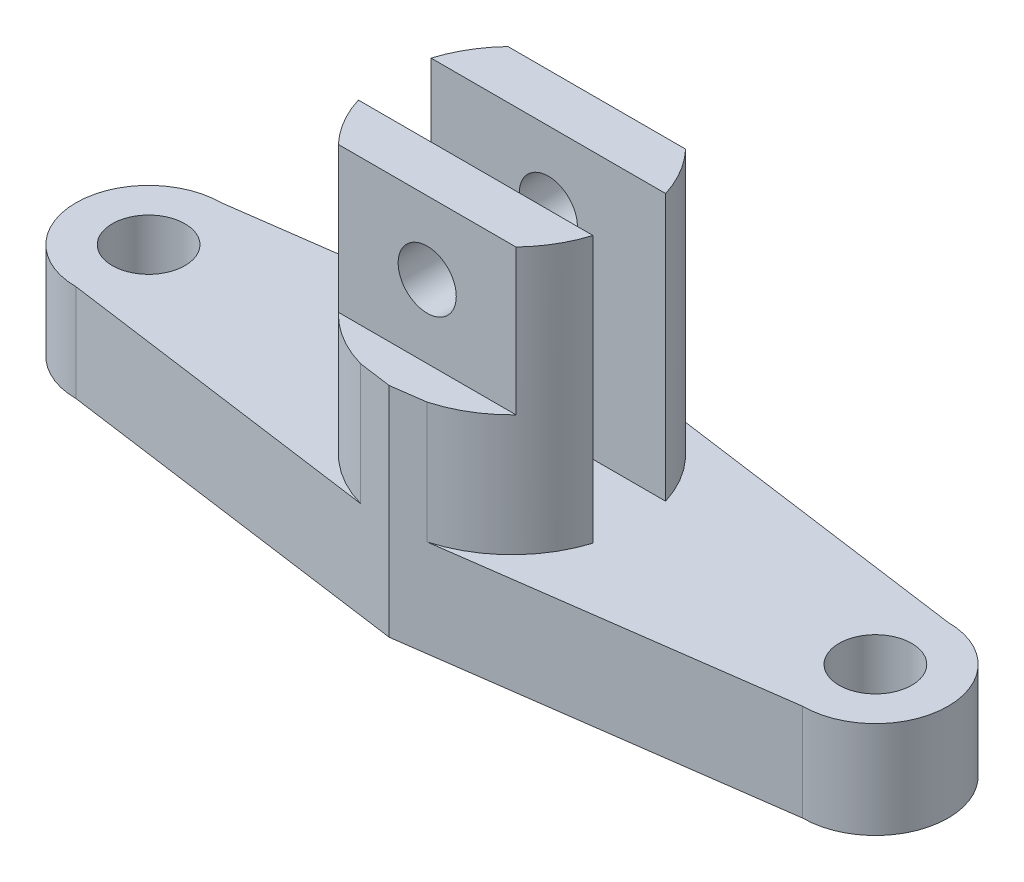
ISO-10303-21;
HEADER;
FILE_DESCRIPTION(('STEP AP214'),'2;1');
FILE_NAME('part.step','',(''),(''),'','','');
FILE_SCHEMA(('AUTOMOTIVE_DESIGN { 1 0 10303 214 1 1 1 1 }'));
ENDSEC;
DATA;
#1=APPLICATION_CONTEXT('core data for automotive mechanical design processes');
#2=APPLICATION_PROTOCOL_DEFINITION('international standard','automotive_design',2000,#1);
#3=PRODUCT_CONTEXT('',#1,'mechanical');
#4=PRODUCT('Part','Part','',(#3));
#5=PRODUCT_RELATED_PRODUCT_CATEGORY('part','',(#4));
#6=PRODUCT_DEFINITION_FORMATION('','',#4);
#7=PRODUCT_DEFINITION_CONTEXT('part definition',#1,'design');
#8=PRODUCT_DEFINITION('design','',#6,#7);
#9=PRODUCT_DEFINITION_SHAPE('','',#8);
#10=(LENGTH_UNIT() NAMED_UNIT(*) SI_UNIT(.MILLI.,.METRE.));
#11=(NAMED_UNIT(*) PLANE_ANGLE_UNIT() SI_UNIT($,.RADIAN.));
#12=(NAMED_UNIT(*) SI_UNIT($,.STERADIAN.) SOLID_ANGLE_UNIT());
#13=UNCERTAINTY_MEASURE_WITH_UNIT(LENGTH_MEASURE(1.E-05),#10,'distance_accuracy_value','');
#14=(GEOMETRIC_REPRESENTATION_CONTEXT(3) GLOBAL_UNCERTAINTY_ASSIGNED_CONTEXT((#13)) GLOBAL_UNIT_ASSIGNED_CONTEXT((#10,
#11,#12)) REPRESENTATION_CONTEXT('',''));
#15=CARTESIAN_POINT('',(0.,0.,0.));
#16=DIRECTION('',(0.,0.,1.));
#17=DIRECTION('',(1.,0.,0.));
#18=AXIS2_PLACEMENT_3D('',#15,#16,#17);
#19=CARTESIAN_POINT('',(0.,45.,0.));
#20=DIRECTION('',(0.,1.,0.));
#21=DIRECTION('',(0.,0.,1.));
#22=AXIS2_PLACEMENT_3D('',#19,#20,#21);
#23=PLANE('',#22);
#24=CARTESIAN_POINT('',(0.,45.,0.));
#25=DIRECTION('',(0.,1.,0.));
#26=DIRECTION('',(0.,0.,1.));
#27=AXIS2_PLACEMENT_3D('',#24,#25,#26);
#28=CIRCLE('',#27,25.3395650697359);
#29=CARTESIAN_POINT('',(-6.85635949504464,45.,-24.3943414011957));
#30=VERTEX_POINT('',#29);
#31=CARTESIAN_POINT('',(-18.3260349755035,45.,-17.5));
#32=VERTEX_POINT('',#31);
#33=EDGE_CURVE('E69',#30,#32,#28,.T.);
#34=ORIENTED_EDGE('',*,*,#33,.T.);
#35=DIRECTION('',(1.,0.,0.));
#36=VECTOR('',#35,1.);
#37=CARTESIAN_POINT('',(0.,45.,-17.5));
#38=LINE('',#37,#36);
#39=CARTESIAN_POINT('',(18.3260349755035,45.,-17.5));
#40=VERTEX_POINT('',#39);
#41=EDGE_CURVE('E55',#32,#40,#38,.T.);
#42=ORIENTED_EDGE('',*,*,#41,.T.);
#43=CARTESIAN_POINT('',(6.85635949504467,45.,-24.3943414011956));
#44=VERTEX_POINT('',#43);
#45=EDGE_CURVE('E237',#40,#44,#28,.T.);
#46=ORIENTED_EDGE('',*,*,#45,.T.);
#47=DIRECTION('',(-0.990630535410051,0.,-0.136569185079193));
#48=VECTOR('',#47,1.);
#49=CARTESIAN_POINT('',(3.42817974752236,45.,-24.8669532354657));
#50=LINE('',#49,#48);
#51=CARTESIAN_POINT('',(0.,45.,-25.3395650697359));
#52=VERTEX_POINT('',#51);
#53=EDGE_CURVE('E240',#44,#52,#50,.T.);
#54=ORIENTED_EDGE('',*,*,#53,.T.);
#55=DIRECTION('',(-0.990630535410051,0.,0.136569185079193));
#56=VECTOR('',#55,1.);
#57=CARTESIAN_POINT('',(-3.42817974752236,45.,-24.8669532354658));
#58=LINE('',#57,#56);
#59=EDGE_CURVE('E245',#52,#30,#58,.T.);
#60=ORIENTED_EDGE('',*,*,#59,.T.);
#61=EDGE_LOOP('',(#34,#42,#46,#54,#60));
#62=FACE_BOUND('',#61,.T.);
#63=ADVANCED_FACE('F45',(#62),#23,.T.);
#64=CARTESIAN_POINT('',(0.,20.,0.));
#65=DIRECTION('',(0.,1.,0.));
#66=DIRECTION('',(0.,0.,1.));
#67=AXIS2_PLACEMENT_3D('',#64,#65,#66);
#68=PLANE('',#67);
#69=CARTESIAN_POINT('',(-75.,20.,0.));
#70=DIRECTION('',(0.,1.,0.));
#71=DIRECTION('',(0.,0.,1.));
#72=AXIS2_PLACEMENT_3D('',#69,#70,#71);
#73=CIRCLE('',#72,7.50000000000001);
#74=CARTESIAN_POINT('',(-75.,20.,7.50000000000001));
#75=VERTEX_POINT('',#74);
#76=EDGE_CURVE('E300',#75,#75,#73,.T.);
#77=ORIENTED_EDGE('',*,*,#76,.F.);
#78=EDGE_LOOP('',(#77));
#79=FACE_BOUND('',#78,.T.);
#80=CARTESIAN_POINT('',(75.,20.,0.));
#81=DIRECTION('',(0.,1.,0.));
#82=DIRECTION('',(0.,0.,1.));
#83=AXIS2_PLACEMENT_3D('',#80,#81,#82);
#84=CIRCLE('',#83,7.5);
#85=CARTESIAN_POINT('',(75.,20.,7.5));
#86=VERTEX_POINT('',#85);
#87=EDGE_CURVE('E325',#86,#86,#84,.T.);
#88=ORIENTED_EDGE('',*,*,#87,.F.);
#89=EDGE_LOOP('',(#88));
#90=FACE_BOUND('',#89,.T.);
#91=DIRECTION('',(-0.990630535410051,0.,-0.136569185079193));
#92=VECTOR('',#91,1.);
#93=CARTESIAN_POINT('',(3.42817974752236,20.,-24.8669532354657));
#94=LINE('',#93,#92);
#95=CARTESIAN_POINT('',(75.,20.,-15.));
#96=VERTEX_POINT('',#95);
#97=CARTESIAN_POINT('',(6.85635949504467,20.,-24.3943414011956));
#98=VERTEX_POINT('',#97);
#99=EDGE_CURVE('E321',#96,#98,#94,.T.);
#100=ORIENTED_EDGE('',*,*,#99,.T.);
#101=CARTESIAN_POINT('',(0.,20.,0.));
#102=DIRECTION('',(0.,1.,0.));
#103=DIRECTION('',(0.,0.,1.));
#104=AXIS2_PLACEMENT_3D('',#101,#102,#103);
#105=CIRCLE('',#104,25.3395650697359);
#106=CARTESIAN_POINT('',(24.204205376822,20.,-7.5));
#107=VERTEX_POINT('',#106);
#108=EDGE_CURVE('E294',#98,#107,#105,.F.);
#109=ORIENTED_EDGE('',*,*,#108,.T.);
#110=DIRECTION('',(-1.,0.,0.));
#111=VECTOR('',#110,1.);
#112=CARTESIAN_POINT('',(0.,20.,-7.5));
#113=LINE('',#112,#111);
#114=CARTESIAN_POINT('',(-24.204205376822,20.,-7.5));
#115=VERTEX_POINT('',#114);
#116=EDGE_CURVE('E180',#107,#115,#113,.T.);
#117=ORIENTED_EDGE('',*,*,#116,.T.);
#118=CARTESIAN_POINT('',(0.,20.,0.));
#119=DIRECTION('',(0.,1.,0.));
#120=DIRECTION('',(0.,0.,1.));
#121=AXIS2_PLACEMENT_3D('',#118,#119,#120);
#122=CIRCLE('',#121,25.3395650697359);
#123=CARTESIAN_POINT('',(-6.85635949504464,20.,-24.3943414011957));
#124=VERTEX_POINT('',#123);
#125=EDGE_CURVE('E291',#115,#124,#122,.F.);
#126=ORIENTED_EDGE('',*,*,#125,.T.);
#127=DIRECTION('',(-0.990630535410051,0.,0.136569185079193));
#128=VECTOR('',#127,1.);
#129=CARTESIAN_POINT('',(-3.42817974752236,20.,-24.8669532354658));
#130=LINE('',#129,#128);
#131=CARTESIAN_POINT('',(-75.,20.,-15.));
#132=VERTEX_POINT('',#131);
#133=EDGE_CURVE('E304',#124,#132,#130,.T.);
#134=ORIENTED_EDGE('',*,*,#133,.T.);
#135=CARTESIAN_POINT('',(-75.,20.,0.));
#136=DIRECTION('',(0.,1.,0.));
#137=DIRECTION('',(0.,0.,1.));
#138=AXIS2_PLACEMENT_3D('',#135,#136,#137);
#139=CIRCLE('',#138,15.);
#140=CARTESIAN_POINT('',(-75.,20.,15.));
#141=VERTEX_POINT('',#140);
#142=EDGE_CURVE('E308',#132,#141,#139,.T.);
#143=ORIENTED_EDGE('',*,*,#142,.T.);
#144=DIRECTION('',(-0.990630535410051,0.,-0.136569185079193));
#145=VECTOR('',#144,1.);
#146=CARTESIAN_POINT('',(-3.42817974752236,20.,24.8669532354658));
#147=LINE('',#146,#145);
#148=CARTESIAN_POINT('',(-6.85635949504464,20.,24.3943414011957));
#149=VERTEX_POINT('',#148);
#150=EDGE_CURVE('E312',#149,#141,#147,.T.);
#151=ORIENTED_EDGE('',*,*,#150,.F.);
#152=CARTESIAN_POINT('',(0.,20.,0.));
#153=DIRECTION('',(0.,1.,0.));
#154=DIRECTION('',(0.,0.,1.));
#155=AXIS2_PLACEMENT_3D('',#152,#153,#154);
#156=CIRCLE('',#155,25.3395650697359);
#157=CARTESIAN_POINT('',(-24.204205376822,20.,7.5));
#158=VERTEX_POINT('',#157);
#159=EDGE_CURVE('E288',#149,#158,#156,.F.);
#160=ORIENTED_EDGE('',*,*,#159,.T.);
#161=DIRECTION('',(-1.,0.,0.));
#162=VECTOR('',#161,1.);
#163=CARTESIAN_POINT('',(0.,20.,7.5));
#164=LINE('',#163,#162);
#165=CARTESIAN_POINT('',(24.204205376822,20.,7.5));
#166=VERTEX_POINT('',#165);
#167=EDGE_CURVE('E183',#166,#158,#164,.T.);
#168=ORIENTED_EDGE('',*,*,#167,.F.);
#169=CARTESIAN_POINT('',(0.,20.,0.));
#170=DIRECTION('',(0.,1.,0.));
#171=DIRECTION('',(0.,0.,1.));
#172=AXIS2_PLACEMENT_3D('',#169,#170,#171);
#173=CIRCLE('',#172,25.3395650697359);
#174=CARTESIAN_POINT('',(6.85635949504464,20.,24.3943414011957));
#175=VERTEX_POINT('',#174);
#176=EDGE_CURVE('E285',#166,#175,#173,.F.);
#177=ORIENTED_EDGE('',*,*,#176,.T.);
#178=DIRECTION('',(0.990630535410051,0.,-0.136569185079193));
#179=VECTOR('',#178,1.);
#180=CARTESIAN_POINT('',(3.42817974752236,20.,24.8669532354658));
#181=LINE('',#180,#179);
#182=CARTESIAN_POINT('',(75.,20.,15.));
#183=VERTEX_POINT('',#182);
#184=EDGE_CURVE('E315',#175,#183,#181,.T.);
#185=ORIENTED_EDGE('',*,*,#184,.T.);
#186=CARTESIAN_POINT('',(75.,20.,0.));
#187=DIRECTION('',(0.,1.,0.));
#188=DIRECTION('',(0.,0.,1.));
#189=AXIS2_PLACEMENT_3D('',#186,#187,#188);
#190=CIRCLE('',#189,15.);
#191=EDGE_CURVE('E318',#183,#96,#190,.T.);
#192=ORIENTED_EDGE('',*,*,#191,.T.);
#193=EDGE_LOOP('',(#100,#109,#117,#126,#134,#143,#151,#160,#168,#177,#185,#192));
#194=FACE_BOUND('',#193,.T.);
#195=ADVANCED_FACE('F389',(#79,#90,#194),#68,.T.);
#196=CARTESIAN_POINT('',(-3.42817974752236,20.,-24.8669532354658));
#197=DIRECTION('',(0.136569185079193,0.,0.990630535410051));
#198=DIRECTION('',(0.990630535410051,0.,-0.136569185079193));
#199=AXIS2_PLACEMENT_3D('',#196,#197,#198);
#200=PLANE('',#199);
#201=DIRECTION('',(-0.990630535410051,0.,0.136569185079193));
#202=VECTOR('',#201,1.);
#203=CARTESIAN_POINT('',(-3.42817974752236,0.,-24.8669532354658));
#204=LINE('',#203,#202);
#205=CARTESIAN_POINT('',(0.,0.,-25.3395650697359));
#206=VERTEX_POINT('',#205);
#207=CARTESIAN_POINT('',(-75.,0.,-15.));
#208=VERTEX_POINT('',#207);
#209=EDGE_CURVE('E333',#206,#208,#204,.T.);
#210=ORIENTED_EDGE('',*,*,#209,.T.);
#211=DIRECTION('',(0.,-1.,0.));
#212=VECTOR('',#211,1.);
#213=CARTESIAN_POINT('',(-75.,20.,-15.));
#214=LINE('',#213,#212);
#215=EDGE_CURVE('E373',#132,#208,#214,.T.);
#216=ORIENTED_EDGE('',*,*,#215,.F.);
#217=ORIENTED_EDGE('',*,*,#133,.F.);
#218=DIRECTION('',(0.,-1.,0.));
#219=VECTOR('',#218,1.);
#220=CARTESIAN_POINT('',(-6.85635949504464,45.,-24.3943414011957));
#221=LINE('',#220,#219);
#222=EDGE_CURVE('E251',#30,#124,#221,.T.);
#223=ORIENTED_EDGE('',*,*,#222,.F.);
#224=ORIENTED_EDGE('',*,*,#59,.F.);
#225=DIRECTION('',(0.,-1.,0.));
#226=VECTOR('',#225,1.);
#227=CARTESIAN_POINT('',(0.,20.,-25.3395650697359));
#228=LINE('',#227,#226);
#229=EDGE_CURVE('E329',#52,#206,#228,.T.);
#230=ORIENTED_EDGE('',*,*,#229,.T.);
#231=EDGE_LOOP('',(#210,#216,#217,#223,#224,#230));
#232=FACE_BOUND('',#231,.T.);
#233=ADVANCED_FACE('F396',(#232),#200,.F.);
#234=CARTESIAN_POINT('',(-75.,20.,0.));
#235=DIRECTION('',(0.,-1.,0.));
#236=DIRECTION('',(0.,0.,-1.));
#237=AXIS2_PLACEMENT_3D('',#234,#235,#236);
#238=CYLINDRICAL_SURFACE('',#237,15.);
#239=CARTESIAN_POINT('',(-75.,0.,0.));
#240=DIRECTION('',(0.,1.,0.));
#241=DIRECTION('',(0.,0.,1.));
#242=AXIS2_PLACEMENT_3D('',#239,#240,#241);
#243=CIRCLE('',#242,15.);
#244=CARTESIAN_POINT('',(-75.,0.,15.));
#245=VERTEX_POINT('',#244);
#246=EDGE_CURVE('E336',#208,#245,#243,.T.);
#247=ORIENTED_EDGE('',*,*,#246,.T.);
#248=DIRECTION('',(0.,-1.,0.));
#249=VECTOR('',#248,1.);
#250=CARTESIAN_POINT('',(-75.,20.,15.));
#251=LINE('',#250,#249);
#252=EDGE_CURVE('E369',#141,#245,#251,.T.);
#253=ORIENTED_EDGE('',*,*,#252,.F.);
#254=ORIENTED_EDGE('',*,*,#142,.F.);
#255=ORIENTED_EDGE('',*,*,#215,.T.);
#256=EDGE_LOOP('',(#247,#253,#254,#255));
#257=FACE_BOUND('',#256,.T.);
#258=ADVANCED_FACE('F403',(#257),#238,.T.);
#259=CARTESIAN_POINT('',(-3.42817974752236,20.,24.8669532354658));
#260=DIRECTION('',(-0.136569185079193,0.,0.990630535410051));
#261=DIRECTION('',(0.990630535410051,0.,0.136569185079193));
#262=AXIS2_PLACEMENT_3D('',#259,#260,#261);
#263=PLANE('',#262);
#264=DIRECTION('',(0.,-1.,0.));
#265=VECTOR('',#264,1.);
#266=CARTESIAN_POINT('',(-6.85635949504464,45.,24.3943414011957));
#267=LINE('',#266,#265);
#268=CARTESIAN_POINT('',(-6.85635949504464,45.,24.3943414011957));
#269=VERTEX_POINT('',#268);
#270=EDGE_CURVE('E241',#269,#149,#267,.T.);
#271=ORIENTED_EDGE('',*,*,#270,.T.);
#272=ORIENTED_EDGE('',*,*,#150,.T.);
#273=ORIENTED_EDGE('',*,*,#252,.T.);
#274=DIRECTION('',(-0.990630535410051,0.,-0.136569185079193));
#275=VECTOR('',#274,1.);
#276=CARTESIAN_POINT('',(-3.42817974752236,0.,24.8669532354658));
#277=LINE('',#276,#275);
#278=CARTESIAN_POINT('',(0.,0.,25.3395650697359));
#279=VERTEX_POINT('',#278);
#280=EDGE_CURVE('E340',#279,#245,#277,.T.);
#281=ORIENTED_EDGE('',*,*,#280,.F.);
#282=DIRECTION('',(0.,-1.,0.));
#283=VECTOR('',#282,1.);
#284=CARTESIAN_POINT('',(0.,20.,25.3395650697359));
#285=LINE('',#284,#283);
#286=CARTESIAN_POINT('',(0.,45.,25.3395650697359));
#287=VERTEX_POINT('',#286);
#288=EDGE_CURVE('E366',#287,#279,#285,.T.);
#289=ORIENTED_EDGE('',*,*,#288,.F.);
#290=DIRECTION('',(-0.990630535410051,0.,-0.136569185079193));
#291=VECTOR('',#290,1.);
#292=CARTESIAN_POINT('',(-3.42817974752236,45.,24.8669532354658));
#293=LINE('',#292,#291);
#294=EDGE_CURVE('E260',#287,#269,#293,.T.);
#295=ORIENTED_EDGE('',*,*,#294,.T.);
#296=EDGE_LOOP('',(#271,#272,#273,#281,#289,#295));
#297=FACE_BOUND('',#296,.T.);
#298=ADVANCED_FACE('F407',(#297),#263,.T.);
#299=CARTESIAN_POINT('',(3.42817974752236,20.,24.8669532354658));
#300=DIRECTION('',(-0.136569185079193,0.,-0.990630535410051));
#301=DIRECTION('',(-0.990630535410051,0.,0.136569185079193));
#302=AXIS2_PLACEMENT_3D('',#299,#300,#301);
#303=PLANE('',#302);
#304=DIRECTION('',(0.990630535410051,0.,-0.136569185079193));
#305=VECTOR('',#304,1.);
#306=CARTESIAN_POINT('',(3.42817974752236,0.,24.8669532354658));
#307=LINE('',#306,#305);
#308=CARTESIAN_POINT('',(75.,0.,15.));
#309=VERTEX_POINT('',#308);
#310=EDGE_CURVE('E343',#279,#309,#307,.T.);
#311=ORIENTED_EDGE('',*,*,#310,.T.);
#312=DIRECTION('',(0.,-1.,0.));
#313=VECTOR('',#312,1.);
#314=CARTESIAN_POINT('',(75.,20.,15.));
#315=LINE('',#314,#313);
#316=EDGE_CURVE('E362',#183,#309,#315,.T.);
#317=ORIENTED_EDGE('',*,*,#316,.F.);
#318=ORIENTED_EDGE('',*,*,#184,.F.);
#319=DIRECTION('',(0.,-1.,0.));
#320=VECTOR('',#319,1.);
#321=CARTESIAN_POINT('',(6.85635949504464,45.,24.3943414011957));
#322=LINE('',#321,#320);
#323=CARTESIAN_POINT('',(6.85635949504464,45.,24.3943414011957));
#324=VERTEX_POINT('',#323);
#325=EDGE_CURVE('E275',#324,#175,#322,.T.);
#326=ORIENTED_EDGE('',*,*,#325,.F.);
#327=DIRECTION('',(0.990630535410051,0.,-0.136569185079193));
#328=VECTOR('',#327,1.);
#329=CARTESIAN_POINT('',(3.42817974752236,45.,24.8669532354658));
#330=LINE('',#329,#328);
#331=EDGE_CURVE('E264',#287,#324,#330,.T.);
#332=ORIENTED_EDGE('',*,*,#331,.F.);
#333=ORIENTED_EDGE('',*,*,#288,.T.);
#334=EDGE_LOOP('',(#311,#317,#318,#326,#332,#333));
#335=FACE_BOUND('',#334,.T.);
#336=ADVANCED_FACE('F425',(#335),#303,.F.);
#337=CARTESIAN_POINT('',(75.,20.,0.));
#338=DIRECTION('',(0.,-1.,0.));
#339=DIRECTION('',(0.,0.,-1.));
#340=AXIS2_PLACEMENT_3D('',#337,#338,#339);
#341=CYLINDRICAL_SURFACE('',#340,15.);
#342=CARTESIAN_POINT('',(75.,0.,0.));
#343=DIRECTION('',(0.,1.,0.));
#344=DIRECTION('',(0.,0.,1.));
#345=AXIS2_PLACEMENT_3D('',#342,#343,#344);
#346=CIRCLE('',#345,15.);
#347=CARTESIAN_POINT('',(75.,0.,-15.));
#348=VERTEX_POINT('',#347);
#349=EDGE_CURVE('E346',#309,#348,#346,.T.);
#350=ORIENTED_EDGE('',*,*,#349,.T.);
#351=DIRECTION('',(0.,-1.,0.));
#352=VECTOR('',#351,1.);
#353=CARTESIAN_POINT('',(75.,20.,-15.));
#354=LINE('',#353,#352);
#355=EDGE_CURVE('E358',#96,#348,#354,.T.);
#356=ORIENTED_EDGE('',*,*,#355,.F.);
#357=ORIENTED_EDGE('',*,*,#191,.F.);
#358=ORIENTED_EDGE('',*,*,#316,.T.);
#359=EDGE_LOOP('',(#350,#356,#357,#358));
#360=FACE_BOUND('',#359,.T.);
#361=ADVANCED_FACE('F431',(#360),#341,.T.);
#362=CARTESIAN_POINT('',(3.42817974752236,20.,-24.8669532354657));
#363=DIRECTION('',(-0.136569185079193,0.,0.990630535410051));
#364=DIRECTION('',(0.990630535410051,0.,0.136569185079193));
#365=AXIS2_PLACEMENT_3D('',#362,#363,#364);
#366=PLANE('',#365);
#367=ORIENTED_EDGE('',*,*,#229,.F.);
#368=ORIENTED_EDGE('',*,*,#53,.F.);
#369=DIRECTION('',(0.,-1.,0.));
#370=VECTOR('',#369,1.);
#371=CARTESIAN_POINT('',(6.85635949504467,45.,-24.3943414011956));
#372=LINE('',#371,#370);
#373=EDGE_CURVE('E184',#44,#98,#372,.T.);
#374=ORIENTED_EDGE('',*,*,#373,.T.);
#375=ORIENTED_EDGE('',*,*,#99,.F.);
#376=ORIENTED_EDGE('',*,*,#355,.T.);
#377=DIRECTION('',(-0.990630535410051,0.,-0.136569185079193));
#378=VECTOR('',#377,1.);
#379=CARTESIAN_POINT('',(3.42817974752236,0.,-24.8669532354657));
#380=LINE('',#379,#378);
#381=EDGE_CURVE('E349',#348,#206,#380,.T.);
#382=ORIENTED_EDGE('',*,*,#381,.T.);
#383=EDGE_LOOP('',(#367,#368,#374,#375,#376,#382));
#384=FACE_BOUND('',#383,.T.);
#385=ADVANCED_FACE('F392',(#384),#366,.F.);
#386=CARTESIAN_POINT('',(-75.,20.,0.));
#387=DIRECTION('',(0.,-1.,0.));
#388=DIRECTION('',(0.,0.,-1.));
#389=AXIS2_PLACEMENT_3D('',#386,#387,#388);
#390=CYLINDRICAL_SURFACE('',#389,7.50000000000001);
#391=ORIENTED_EDGE('',*,*,#76,.T.);
#392=EDGE_LOOP('',(#391));
#393=FACE_BOUND('',#392,.T.);
#394=CARTESIAN_POINT('',(-75.,0.,0.));
#395=DIRECTION('',(0.,1.,0.));
#396=DIRECTION('',(0.,0.,1.));
#397=AXIS2_PLACEMENT_3D('',#394,#395,#396);
#398=CIRCLE('',#397,7.50000000000001);
#399=CARTESIAN_POINT('',(-75.,0.,7.50000000000001));
#400=VERTEX_POINT('',#399);
#401=EDGE_CURVE('E299',#400,#400,#398,.T.);
#402=ORIENTED_EDGE('',*,*,#401,.F.);
#403=EDGE_LOOP('',(#402));
#404=FACE_BOUND('',#403,.T.);
#405=ADVANCED_FACE('F47',(#393,#404),#390,.F.);
#406=CARTESIAN_POINT('',(75.,20.,0.));
#407=DIRECTION('',(0.,-1.,0.));
#408=DIRECTION('',(0.,0.,-1.));
#409=AXIS2_PLACEMENT_3D('',#406,#407,#408);
#410=CYLINDRICAL_SURFACE('',#409,7.5);
#411=ORIENTED_EDGE('',*,*,#87,.T.);
#412=EDGE_LOOP('',(#411));
#413=FACE_BOUND('',#412,.T.);
#414=CARTESIAN_POINT('',(75.,0.,0.));
#415=DIRECTION('',(0.,1.,0.));
#416=DIRECTION('',(0.,0.,1.));
#417=AXIS2_PLACEMENT_3D('',#414,#415,#416);
#418=CIRCLE('',#417,7.5);
#419=CARTESIAN_POINT('',(75.,0.,7.5));
#420=VERTEX_POINT('',#419);
#421=EDGE_CURVE('E305',#420,#420,#418,.T.);
#422=ORIENTED_EDGE('',*,*,#421,.F.);
#423=EDGE_LOOP('',(#422));
#424=FACE_BOUND('',#423,.T.);
#425=ADVANCED_FACE('F493',(#413,#424),#410,.F.);
#426=CARTESIAN_POINT('',(0.,0.,0.));
#427=DIRECTION('',(0.,1.,0.));
#428=DIRECTION('',(0.,0.,1.));
#429=AXIS2_PLACEMENT_3D('',#426,#427,#428);
#430=PLANE('',#429);
#431=ORIENTED_EDGE('',*,*,#349,.F.);
#432=ORIENTED_EDGE('',*,*,#310,.F.);
#433=ORIENTED_EDGE('',*,*,#280,.T.);
#434=ORIENTED_EDGE('',*,*,#246,.F.);
#435=ORIENTED_EDGE('',*,*,#209,.F.);
#436=ORIENTED_EDGE('',*,*,#381,.F.);
#437=EDGE_LOOP('',(#431,#432,#433,#434,#435,#436));
#438=FACE_BOUND('',#437,.T.);
#439=ORIENTED_EDGE('',*,*,#401,.T.);
#440=EDGE_LOOP('',(#439));
#441=FACE_BOUND('',#440,.T.);
#442=ORIENTED_EDGE('',*,*,#421,.T.);
#443=EDGE_LOOP('',(#442));
#444=FACE_BOUND('',#443,.T.);
#445=ADVANCED_FACE('F435',(#438,#441,#444),#430,.F.);
#446=CARTESIAN_POINT('',(0.,45.,0.));
#447=DIRECTION('',(0.,-1.,0.));
#448=DIRECTION('',(0.,0.,-1.));
#449=AXIS2_PLACEMENT_3D('',#446,#447,#448);
#450=CYLINDRICAL_SURFACE('',#449,25.3395650697359);
#451=CARTESIAN_POINT('',(0.,45.,0.));
#452=DIRECTION('',(0.,1.,0.));
#453=DIRECTION('',(0.,0.,1.));
#454=AXIS2_PLACEMENT_3D('',#451,#452,#453);
#455=CIRCLE('',#454,25.3395650697359);
#456=CARTESIAN_POINT('',(-18.3260349755035,45.,17.5));
#457=VERTEX_POINT('',#456);
#458=EDGE_CURVE('E220',#457,#269,#455,.T.);
#459=ORIENTED_EDGE('',*,*,#458,.F.);
#460=DIRECTION('',(0.,-1.,0.));
#461=VECTOR('',#460,1.);
#462=CARTESIAN_POINT('',(-18.3260349755035,75.,17.5));
#463=LINE('',#462,#461);
#464=CARTESIAN_POINT('',(-18.3260349755035,75.,17.5));
#465=VERTEX_POINT('',#464);
#466=EDGE_CURVE('E206',#465,#457,#463,.T.);
#467=ORIENTED_EDGE('',*,*,#466,.F.);
#468=CARTESIAN_POINT('',(0.,75.,0.));
#469=DIRECTION('',(0.,1.,0.));
#470=DIRECTION('',(0.,0.,1.));
#471=AXIS2_PLACEMENT_3D('',#468,#469,#470);
#472=CIRCLE('',#471,25.3395650697359);
#473=CARTESIAN_POINT('',(-24.204205376822,75.,7.5));
#474=VERTEX_POINT('',#473);
#475=EDGE_CURVE('E230',#474,#465,#472,.T.);
#476=ORIENTED_EDGE('',*,*,#475,.F.);
#477=DIRECTION('',(0.,-1.,0.));
#478=VECTOR('',#477,1.);
#479=CARTESIAN_POINT('',(-24.204205376822,45.,7.5));
#480=LINE('',#479,#478);
#481=EDGE_CURVE('E267',#474,#158,#480,.T.);
#482=ORIENTED_EDGE('',*,*,#481,.T.);
#483=ORIENTED_EDGE('',*,*,#159,.F.);
#484=ORIENTED_EDGE('',*,*,#270,.F.);
#485=EDGE_LOOP('',(#459,#467,#476,#482,#483,#484));
#486=FACE_BOUND('',#485,.T.);
#487=ADVANCED_FACE('F411',(#486),#450,.T.);
#488=ORIENTED_EDGE('',*,*,#325,.T.);
#489=ORIENTED_EDGE('',*,*,#176,.F.);
#490=DIRECTION('',(0.,-1.,0.));
#491=VECTOR('',#490,1.);
#492=CARTESIAN_POINT('',(24.204205376822,45.,7.5));
#493=LINE('',#492,#491);
#494=CARTESIAN_POINT('',(24.204205376822,75.,7.5));
#495=VERTEX_POINT('',#494);
#496=EDGE_CURVE('E271',#495,#166,#493,.T.);
#497=ORIENTED_EDGE('',*,*,#496,.F.);
#498=CARTESIAN_POINT('',(18.3260349755035,75.,17.5));
#499=VERTEX_POINT('',#498);
#500=EDGE_CURVE('E225',#499,#495,#472,.T.);
#501=ORIENTED_EDGE('',*,*,#500,.F.);
#502=DIRECTION('',(0.,-1.,0.));
#503=VECTOR('',#502,1.);
#504=CARTESIAN_POINT('',(18.3260349755035,75.,17.5));
#505=LINE('',#504,#503);
#506=CARTESIAN_POINT('',(18.3260349755035,45.,17.5));
#507=VERTEX_POINT('',#506);
#508=EDGE_CURVE('E202',#499,#507,#505,.T.);
#509=ORIENTED_EDGE('',*,*,#508,.T.);
#510=EDGE_CURVE('E62',#324,#507,#455,.T.);
#511=ORIENTED_EDGE('',*,*,#510,.F.);
#512=EDGE_LOOP('',(#488,#489,#497,#501,#509,#511));
#513=FACE_BOUND('',#512,.T.);
#514=ADVANCED_FACE('F420',(#513),#450,.T.);
#515=CARTESIAN_POINT('',(0.,45.,7.5));
#516=DIRECTION('',(0.,0.,-1.));
#517=DIRECTION('',(-1.,0.,0.));
#518=AXIS2_PLACEMENT_3D('',#515,#516,#517);
#519=PLANE('',#518);
#520=CARTESIAN_POINT('',(0.,60.,7.5));
#521=DIRECTION('',(0.,0.,-1.));
#522=DIRECTION('',(-1.,0.,0.));
#523=AXIS2_PLACEMENT_3D('',#520,#521,#522);
#524=CIRCLE('',#523,6.);
#525=CARTESIAN_POINT('',(-6.,60.,7.5));
#526=VERTEX_POINT('',#525);
#527=EDGE_CURVE('E209',#526,#526,#524,.T.);
#528=ORIENTED_EDGE('',*,*,#527,.F.);
#529=EDGE_LOOP('',(#528));
#530=FACE_BOUND('',#529,.T.);
#531=ORIENTED_EDGE('',*,*,#496,.T.);
#532=ORIENTED_EDGE('',*,*,#167,.T.);
#533=ORIENTED_EDGE('',*,*,#481,.F.);
#534=DIRECTION('',(1.,0.,0.));
#535=VECTOR('',#534,1.);
#536=CARTESIAN_POINT('',(0.,75.,7.5));
#537=LINE('',#536,#535);
#538=EDGE_CURVE('E229',#474,#495,#537,.T.);
#539=ORIENTED_EDGE('',*,*,#538,.T.);
#540=EDGE_LOOP('',(#531,#532,#533,#539));
#541=FACE_BOUND('',#540,.T.);
#542=ADVANCED_FACE('F416',(#530,#541),#519,.T.);
#543=CARTESIAN_POINT('',(0.,45.,0.));
#544=DIRECTION('',(0.,1.,0.));
#545=DIRECTION('',(0.,0.,1.));
#546=AXIS2_PLACEMENT_3D('',#543,#544,#545);
#547=PLANE('',#546);
#548=DIRECTION('',(1.,0.,0.));
#549=VECTOR('',#548,1.);
#550=CARTESIAN_POINT('',(0.,45.,17.5));
#551=LINE('',#550,#549);
#552=EDGE_CURVE('E11',#457,#507,#551,.T.);
#553=ORIENTED_EDGE('',*,*,#552,.F.);
#554=ORIENTED_EDGE('',*,*,#458,.T.);
#555=ORIENTED_EDGE('',*,*,#294,.F.);
#556=ORIENTED_EDGE('',*,*,#331,.T.);
#557=ORIENTED_EDGE('',*,*,#510,.T.);
#558=EDGE_LOOP('',(#553,#554,#555,#556,#557));
#559=FACE_BOUND('',#558,.T.);
#560=ADVANCED_FACE('F438',(#559),#547,.T.);
#561=CARTESIAN_POINT('',(0.,45.,-7.5));
#562=DIRECTION('',(0.,0.,-1.));
#563=DIRECTION('',(-1.,0.,0.));
#564=AXIS2_PLACEMENT_3D('',#561,#562,#563);
#565=PLANE('',#564);
#566=CARTESIAN_POINT('',(0.,60.,-7.5));
#567=DIRECTION('',(0.,0.,-1.));
#568=DIRECTION('',(-1.,0.,0.));
#569=AXIS2_PLACEMENT_3D('',#566,#567,#568);
#570=CIRCLE('',#569,6.);
#571=CARTESIAN_POINT('',(-6.,60.,-7.5));
#572=VERTEX_POINT('',#571);
#573=EDGE_CURVE('E448',#572,#572,#570,.T.);
#574=ORIENTED_EDGE('',*,*,#573,.T.);
#575=EDGE_LOOP('',(#574));
#576=FACE_BOUND('',#575,.T.);
#577=ORIENTED_EDGE('',*,*,#116,.F.);
#578=DIRECTION('',(0.,-1.,0.));
#579=VECTOR('',#578,1.);
#580=CARTESIAN_POINT('',(24.204205376822,45.,-7.5));
#581=LINE('',#580,#579);
#582=CARTESIAN_POINT('',(24.204205376822,75.,-7.5));
#583=VERTEX_POINT('',#582);
#584=EDGE_CURVE('E173',#583,#107,#581,.T.);
#585=ORIENTED_EDGE('',*,*,#584,.F.);
#586=DIRECTION('',(1.,0.,0.));
#587=VECTOR('',#586,1.);
#588=CARTESIAN_POINT('',(0.,75.,-7.5));
#589=LINE('',#588,#587);
#590=CARTESIAN_POINT('',(-24.204205376822,75.,-7.5));
#591=VERTEX_POINT('',#590);
#592=EDGE_CURVE('E178',#591,#583,#589,.T.);
#593=ORIENTED_EDGE('',*,*,#592,.F.);
#594=DIRECTION('',(0.,-1.,0.));
#595=VECTOR('',#594,1.);
#596=CARTESIAN_POINT('',(-24.204205376822,45.,-7.5));
#597=LINE('',#596,#595);
#598=EDGE_CURVE('E248',#591,#115,#597,.T.);
#599=ORIENTED_EDGE('',*,*,#598,.T.);
#600=EDGE_LOOP('',(#577,#585,#593,#599));
#601=FACE_BOUND('',#600,.T.);
#602=ADVANCED_FACE('F175',(#576,#601),#565,.F.);
#603=CARTESIAN_POINT('',(0.,45.,0.));
#604=DIRECTION('',(0.,-1.,0.));
#605=DIRECTION('',(0.,0.,-1.));
#606=AXIS2_PLACEMENT_3D('',#603,#604,#605);
#607=CYLINDRICAL_SURFACE('',#606,25.3395650697359);
#608=ORIENTED_EDGE('',*,*,#584,.T.);
#609=ORIENTED_EDGE('',*,*,#108,.F.);
#610=ORIENTED_EDGE('',*,*,#373,.F.);
#611=ORIENTED_EDGE('',*,*,#45,.F.);
#612=DIRECTION('',(0.,-1.,0.));
#613=VECTOR('',#612,1.);
#614=CARTESIAN_POINT('',(18.3260349755035,75.,-17.5));
#615=LINE('',#614,#613);
#616=CARTESIAN_POINT('',(18.3260349755035,75.,-17.5));
#617=VERTEX_POINT('',#616);
#618=EDGE_CURVE('E191',#617,#40,#615,.T.);
#619=ORIENTED_EDGE('',*,*,#618,.F.);
#620=CARTESIAN_POINT('',(0.,75.,0.));
#621=DIRECTION('',(0.,1.,0.));
#622=DIRECTION('',(0.,0.,1.));
#623=AXIS2_PLACEMENT_3D('',#620,#621,#622);
#624=CIRCLE('',#623,25.3395650697359);
#625=EDGE_CURVE('E187',#583,#617,#624,.T.);
#626=ORIENTED_EDGE('',*,*,#625,.F.);
#627=EDGE_LOOP('',(#608,#609,#610,#611,#619,#626));
#628=FACE_BOUND('',#627,.T.);
#629=ADVANCED_FACE('F188',(#628),#607,.T.);
#630=ORIENTED_EDGE('',*,*,#598,.F.);
#631=CARTESIAN_POINT('',(-18.3260349755035,75.,-17.5));
#632=VERTEX_POINT('',#631);
#633=EDGE_CURVE('E197',#632,#591,#624,.T.);
#634=ORIENTED_EDGE('',*,*,#633,.F.);
#635=DIRECTION('',(0.,-1.,0.));
#636=VECTOR('',#635,1.);
#637=CARTESIAN_POINT('',(-18.3260349755035,75.,-17.5));
#638=LINE('',#637,#636);
#639=EDGE_CURVE('E214',#632,#32,#638,.T.);
#640=ORIENTED_EDGE('',*,*,#639,.T.);
#641=ORIENTED_EDGE('',*,*,#33,.F.);
#642=ORIENTED_EDGE('',*,*,#222,.T.);
#643=ORIENTED_EDGE('',*,*,#125,.F.);
#644=EDGE_LOOP('',(#630,#634,#640,#641,#642,#643));
#645=FACE_BOUND('',#644,.T.);
#646=ADVANCED_FACE('F384',(#645),#607,.T.);
#647=CARTESIAN_POINT('',(0.,75.,-17.5));
#648=DIRECTION('',(0.,0.,1.));
#649=DIRECTION('',(1.,0.,0.));
#650=AXIS2_PLACEMENT_3D('',#647,#648,#649);
#651=PLANE('',#650);
#652=CARTESIAN_POINT('',(0.,60.,-17.5));
#653=DIRECTION('',(0.,0.,1.));
#654=DIRECTION('',(1.,0.,0.));
#655=AXIS2_PLACEMENT_3D('',#652,#653,#654);
#656=CIRCLE('',#655,6.);
#657=CARTESIAN_POINT('',(6.,60.,-17.5));
#658=VERTEX_POINT('',#657);
#659=EDGE_CURVE('E451',#658,#658,#656,.T.);
#660=ORIENTED_EDGE('',*,*,#659,.T.);
#661=EDGE_LOOP('',(#660));
#662=FACE_BOUND('',#661,.T.);
#663=ORIENTED_EDGE('',*,*,#41,.F.);
#664=ORIENTED_EDGE('',*,*,#639,.F.);
#665=DIRECTION('',(-1.,0.,0.));
#666=VECTOR('',#665,1.);
#667=CARTESIAN_POINT('',(0.,75.,-17.5));
#668=LINE('',#667,#666);
#669=EDGE_CURVE('E195',#617,#632,#668,.T.);
#670=ORIENTED_EDGE('',*,*,#669,.F.);
#671=ORIENTED_EDGE('',*,*,#618,.T.);
#672=EDGE_LOOP('',(#663,#664,#670,#671));
#673=FACE_BOUND('',#672,.T.);
#674=ADVANCED_FACE('F382',(#662,#673),#651,.F.);
#675=CARTESIAN_POINT('',(0.,75.,0.));
#676=DIRECTION('',(0.,1.,0.));
#677=DIRECTION('',(0.,0.,1.));
#678=AXIS2_PLACEMENT_3D('',#675,#676,#677);
#679=PLANE('',#678);
#680=ORIENTED_EDGE('',*,*,#592,.T.);
#681=ORIENTED_EDGE('',*,*,#625,.T.);
#682=ORIENTED_EDGE('',*,*,#669,.T.);
#683=ORIENTED_EDGE('',*,*,#633,.T.);
#684=EDGE_LOOP('',(#680,#681,#682,#683));
#685=FACE_BOUND('',#684,.T.);
#686=ADVANCED_FACE('F199',(#685),#679,.T.);
#687=CARTESIAN_POINT('',(0.,75.,17.5));
#688=DIRECTION('',(0.,0.,1.));
#689=DIRECTION('',(1.,0.,0.));
#690=AXIS2_PLACEMENT_3D('',#687,#688,#689);
#691=PLANE('',#690);
#692=CARTESIAN_POINT('',(0.,60.,17.5));
#693=DIRECTION('',(0.,0.,1.));
#694=DIRECTION('',(1.,0.,0.));
#695=AXIS2_PLACEMENT_3D('',#692,#693,#694);
#696=CIRCLE('',#695,6.);
#697=CARTESIAN_POINT('',(6.,60.,17.5));
#698=VERTEX_POINT('',#697);
#699=EDGE_CURVE('E49',#698,#698,#696,.T.);
#700=ORIENTED_EDGE('',*,*,#699,.F.);
#701=EDGE_LOOP('',(#700));
#702=FACE_BOUND('',#701,.T.);
#703=ORIENTED_EDGE('',*,*,#466,.T.);
#704=ORIENTED_EDGE('',*,*,#552,.T.);
#705=ORIENTED_EDGE('',*,*,#508,.F.);
#706=DIRECTION('',(-1.,0.,0.));
#707=VECTOR('',#706,1.);
#708=CARTESIAN_POINT('',(0.,75.,17.5));
#709=LINE('',#708,#707);
#710=EDGE_CURVE('E221',#499,#465,#709,.T.);
#711=ORIENTED_EDGE('',*,*,#710,.T.);
#712=EDGE_LOOP('',(#703,#704,#705,#711));
#713=FACE_BOUND('',#712,.T.);
#714=ADVANCED_FACE('F441',(#702,#713),#691,.T.);
#715=CARTESIAN_POINT('',(0.,75.,0.));
#716=DIRECTION('',(0.,1.,0.));
#717=DIRECTION('',(0.,0.,1.));
#718=AXIS2_PLACEMENT_3D('',#715,#716,#717);
#719=PLANE('',#718);
#720=ORIENTED_EDGE('',*,*,#710,.F.);
#721=ORIENTED_EDGE('',*,*,#500,.T.);
#722=ORIENTED_EDGE('',*,*,#538,.F.);
#723=ORIENTED_EDGE('',*,*,#475,.T.);
#724=EDGE_LOOP('',(#720,#721,#722,#723));
#725=FACE_BOUND('',#724,.T.);
#726=ADVANCED_FACE('F443',(#725),#719,.T.);
#727=CARTESIAN_POINT('',(0.,60.,25.3395650697359));
#728=DIRECTION('',(0.,0.,-1.));
#729=DIRECTION('',(-1.,0.,0.));
#730=AXIS2_PLACEMENT_3D('',#727,#728,#729);
#731=CYLINDRICAL_SURFACE('',#730,6.);
#732=ORIENTED_EDGE('',*,*,#527,.T.);
#733=EDGE_LOOP('',(#732));
#734=FACE_BOUND('',#733,.T.);
#735=ORIENTED_EDGE('',*,*,#699,.T.);
#736=EDGE_LOOP('',(#735));
#737=FACE_BOUND('',#736,.T.);
#738=ADVANCED_FACE('F458',(#734,#737),#731,.F.);
#739=ORIENTED_EDGE('',*,*,#659,.F.);
#740=EDGE_LOOP('',(#739));
#741=FACE_BOUND('',#740,.T.);
#742=ORIENTED_EDGE('',*,*,#573,.F.);
#743=EDGE_LOOP('',(#742));
#744=FACE_BOUND('',#743,.T.);
#745=ADVANCED_FACE('F627',(#741,#744),#731,.F.);
#746=CLOSED_SHELL('',(#63,#195,#233,#258,#298,#336,#361,#385,#405,#425,#445,#487,#514,#542,#560,
#602,#629,#646,#674,#686,#714,#726,#738,#745));
#747=MANIFOLD_SOLID_BREP('B2',#746);
#748=ADVANCED_BREP_SHAPE_REPRESENTATION('',(#18,#747),#14);
#749=SHAPE_DEFINITION_REPRESENTATION(#9,#748);
ENDSEC;
END-ISO-10303-21;
